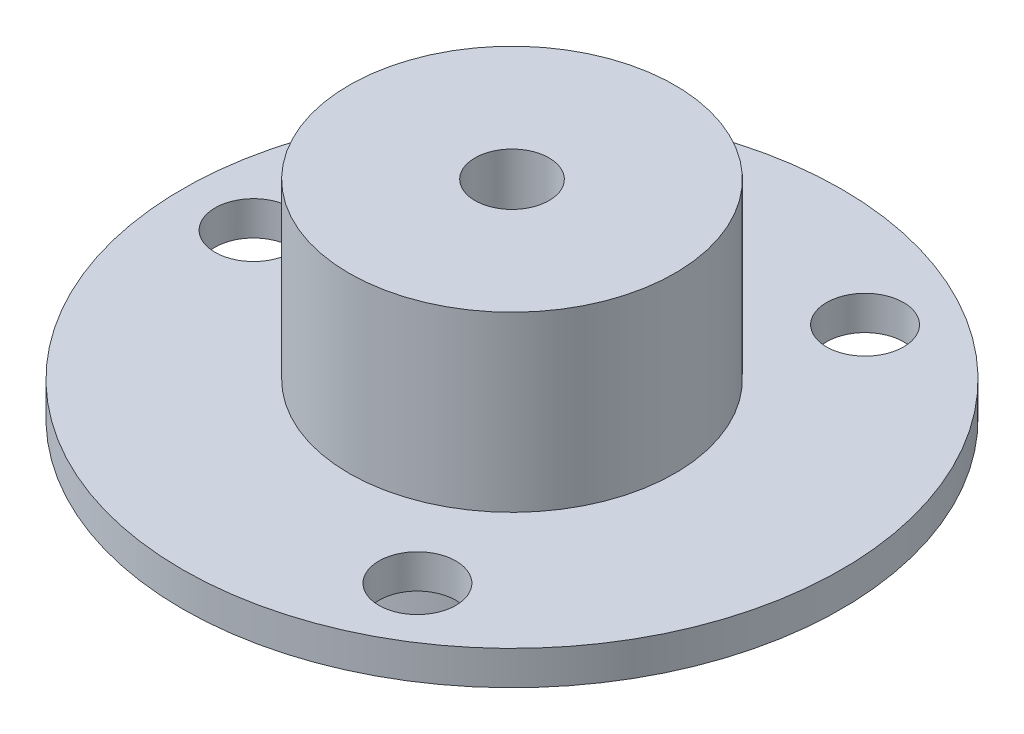
ISO-10303-21;
HEADER;
FILE_DESCRIPTION(('STEP AP214'),'2;1');
FILE_NAME('part.step','',(''),(''),'','','');
FILE_SCHEMA(('AUTOMOTIVE_DESIGN { 1 0 10303 214 1 1 1 1 }'));
ENDSEC;
DATA;
#1=APPLICATION_CONTEXT('core data for automotive mechanical design processes');
#2=APPLICATION_PROTOCOL_DEFINITION('international standard','automotive_design',2000,#1);
#3=PRODUCT_CONTEXT('',#1,'mechanical');
#4=PRODUCT('Part','Part','',(#3));
#5=PRODUCT_RELATED_PRODUCT_CATEGORY('part','',(#4));
#6=PRODUCT_DEFINITION_FORMATION('','',#4);
#7=PRODUCT_DEFINITION_CONTEXT('part definition',#1,'design');
#8=PRODUCT_DEFINITION('design','',#6,#7);
#9=PRODUCT_DEFINITION_SHAPE('','',#8);
#10=(LENGTH_UNIT() NAMED_UNIT(*) SI_UNIT(.MILLI.,.METRE.));
#11=(NAMED_UNIT(*) PLANE_ANGLE_UNIT() SI_UNIT($,.RADIAN.));
#12=(NAMED_UNIT(*) SI_UNIT($,.STERADIAN.) SOLID_ANGLE_UNIT());
#13=UNCERTAINTY_MEASURE_WITH_UNIT(LENGTH_MEASURE(1.E-05),#10,'distance_accuracy_value','');
#14=(GEOMETRIC_REPRESENTATION_CONTEXT(3) GLOBAL_UNCERTAINTY_ASSIGNED_CONTEXT((#13)) GLOBAL_UNIT_ASSIGNED_CONTEXT((#10,
#11,#12)) REPRESENTATION_CONTEXT('',''));
#15=CARTESIAN_POINT('',(0.,0.,0.));
#16=DIRECTION('',(0.,0.,1.));
#17=DIRECTION('',(1.,0.,0.));
#18=AXIS2_PLACEMENT_3D('',#15,#16,#17);
#19=CARTESIAN_POINT('',(-3.10351832152472,-8.,1.61807726266714));
#20=DIRECTION('',(0.,1.,0.));
#21=DIRECTION('',(0.,0.,1.));
#22=AXIS2_PLACEMENT_3D('',#19,#20,#21);
#23=CYLINDRICAL_SURFACE('',#22,0.5);
#24=CARTESIAN_POINT('',(-3.10351832152472,-8.,1.61807726266714));
#25=DIRECTION('',(0.,-1.,0.));
#26=DIRECTION('',(0.,0.,1.));
#27=AXIS2_PLACEMENT_3D('',#24,#25,#26);
#28=CIRCLE('',#27,0.5);
#29=CARTESIAN_POINT('',(-3.10351832152472,-8.,2.11807726266714));
#30=VERTEX_POINT('',#29);
#31=EDGE_CURVE('E11',#30,#30,#28,.T.);
#32=ORIENTED_EDGE('',*,*,#31,.F.);
#33=EDGE_LOOP('',(#32));
#34=FACE_BOUND('',#33,.T.);
#35=CARTESIAN_POINT('',(-3.10351832152472,-5.,1.61807726266714));
#36=DIRECTION('',(0.,-1.,0.));
#37=DIRECTION('',(0.,0.,1.));
#38=AXIS2_PLACEMENT_3D('',#35,#36,#37);
#39=CIRCLE('',#38,0.5);
#40=CARTESIAN_POINT('',(-3.10351832152472,-5.,2.11807726266714));
#41=VERTEX_POINT('',#40);
#42=EDGE_CURVE('E52',#41,#41,#39,.T.);
#43=ORIENTED_EDGE('',*,*,#42,.T.);
#44=EDGE_LOOP('',(#43));
#45=FACE_BOUND('',#44,.T.);
#46=ADVANCED_FACE('F49',(#34,#45),#23,.T.);
#47=CARTESIAN_POINT('',(-3.10351832152472,-8.,1.61807726266714));
#48=DIRECTION('',(0.,1.,0.));
#49=DIRECTION('',(0.,0.,1.));
#50=AXIS2_PLACEMENT_3D('',#47,#48,#49);
#51=PLANE('',#50);
#52=ORIENTED_EDGE('',*,*,#31,.T.);
#53=EDGE_LOOP('',(#52));
#54=FACE_BOUND('',#53,.T.);
#55=ADVANCED_FACE('F64',(#54),#51,.F.);
#56=CARTESIAN_POINT('',(-3.10351832152472,-5.,1.61807726266714));
#57=DIRECTION('',(0.,1.,0.));
#58=DIRECTION('',(0.,0.,1.));
#59=AXIS2_PLACEMENT_3D('',#56,#57,#58);
#60=PLANE('',#59);
#61=ORIENTED_EDGE('',*,*,#42,.F.);
#62=EDGE_LOOP('',(#61));
#63=FACE_BOUND('',#62,.T.);
#64=ADVANCED_FACE('F62',(#63),#60,.T.);
#65=CLOSED_SHELL('',(#46,#55,#64));
#66=MANIFOLD_SOLID_BREP('B2',#65);
#67=CARTESIAN_POINT('',(-3.5,-8.,0.));
#68=DIRECTION('',(0.,1.,0.));
#69=DIRECTION('',(0.,0.,1.));
#70=AXIS2_PLACEMENT_3D('',#67,#68,#69);
#71=CYLINDRICAL_SURFACE('',#70,0.500000000000001);
#72=CARTESIAN_POINT('',(-3.5,-8.,0.));
#73=DIRECTION('',(0.,-1.,0.));
#74=DIRECTION('',(0.,0.,1.));
#75=AXIS2_PLACEMENT_3D('',#72,#73,#74);
#76=CIRCLE('',#75,0.500000000000001);
#77=CARTESIAN_POINT('',(-3.5,-8.,0.500000000000001));
#78=VERTEX_POINT('',#77);
#79=EDGE_CURVE('E48',#78,#78,#76,.T.);
#80=ORIENTED_EDGE('',*,*,#79,.F.);
#81=EDGE_LOOP('',(#80));
#82=FACE_BOUND('',#81,.T.);
#83=CARTESIAN_POINT('',(-3.5,-5.,0.));
#84=DIRECTION('',(0.,-1.,0.));
#85=DIRECTION('',(0.,0.,1.));
#86=AXIS2_PLACEMENT_3D('',#83,#84,#85);
#87=CIRCLE('',#86,0.500000000000001);
#88=CARTESIAN_POINT('',(-3.5,-5.,0.500000000000001));
#89=VERTEX_POINT('',#88);
#90=EDGE_CURVE('E102',#89,#89,#87,.T.);
#91=ORIENTED_EDGE('',*,*,#90,.T.);
#92=EDGE_LOOP('',(#91));
#93=FACE_BOUND('',#92,.T.);
#94=ADVANCED_FACE('F99',(#82,#93),#71,.T.);
#95=CARTESIAN_POINT('',(-3.5,-8.,0.));
#96=DIRECTION('',(0.,1.,0.));
#97=DIRECTION('',(0.,0.,1.));
#98=AXIS2_PLACEMENT_3D('',#95,#96,#97);
#99=PLANE('',#98);
#100=ORIENTED_EDGE('',*,*,#79,.T.);
#101=EDGE_LOOP('',(#100));
#102=FACE_BOUND('',#101,.T.);
#103=ADVANCED_FACE('F114',(#102),#99,.F.);
#104=CARTESIAN_POINT('',(-3.5,-5.,0.));
#105=DIRECTION('',(0.,1.,0.));
#106=DIRECTION('',(0.,0.,1.));
#107=AXIS2_PLACEMENT_3D('',#104,#105,#106);
#108=PLANE('',#107);
#109=ORIENTED_EDGE('',*,*,#90,.F.);
#110=EDGE_LOOP('',(#109));
#111=FACE_BOUND('',#110,.T.);
#112=ADVANCED_FACE('F112',(#111),#108,.T.);
#113=CLOSED_SHELL('',(#94,#103,#112));
#114=MANIFOLD_SOLID_BREP('B6',#113);
#115=CARTESIAN_POINT('',(-3.08989592419614,-8.,-1.64394135468273));
#116=DIRECTION('',(0.,1.,0.));
#117=DIRECTION('',(0.,0.,1.));
#118=AXIS2_PLACEMENT_3D('',#115,#116,#117);
#119=CYLINDRICAL_SURFACE('',#118,0.5);
#120=CARTESIAN_POINT('',(-3.08989592419614,-8.,-1.64394135468273));
#121=DIRECTION('',(0.,-1.,0.));
#122=DIRECTION('',(0.,0.,1.));
#123=AXIS2_PLACEMENT_3D('',#120,#121,#122);
#124=CIRCLE('',#123,0.5);
#125=CARTESIAN_POINT('',(-3.08989592419614,-8.,-1.14394135468273));
#126=VERTEX_POINT('',#125);
#127=EDGE_CURVE('E98',#126,#126,#124,.T.);
#128=ORIENTED_EDGE('',*,*,#127,.F.);
#129=EDGE_LOOP('',(#128));
#130=FACE_BOUND('',#129,.T.);
#131=CARTESIAN_POINT('',(-3.08989592419614,-5.,-1.64394135468273));
#132=DIRECTION('',(0.,-1.,0.));
#133=DIRECTION('',(0.,0.,1.));
#134=AXIS2_PLACEMENT_3D('',#131,#132,#133);
#135=CIRCLE('',#134,0.5);
#136=CARTESIAN_POINT('',(-3.08989592419614,-5.,-1.14394135468273));
#137=VERTEX_POINT('',#136);
#138=EDGE_CURVE('E152',#137,#137,#135,.T.);
#139=ORIENTED_EDGE('',*,*,#138,.T.);
#140=EDGE_LOOP('',(#139));
#141=FACE_BOUND('',#140,.T.);
#142=ADVANCED_FACE('F149',(#130,#141),#119,.T.);
#143=CARTESIAN_POINT('',(-3.08989592419614,-8.,-1.64394135468273));
#144=DIRECTION('',(0.,1.,0.));
#145=DIRECTION('',(0.,0.,1.));
#146=AXIS2_PLACEMENT_3D('',#143,#144,#145);
#147=PLANE('',#146);
#148=ORIENTED_EDGE('',*,*,#127,.T.);
#149=EDGE_LOOP('',(#148));
#150=FACE_BOUND('',#149,.T.);
#151=ADVANCED_FACE('F164',(#150),#147,.F.);
#152=CARTESIAN_POINT('',(-3.08989592419614,-5.,-1.64394135468273));
#153=DIRECTION('',(0.,1.,0.));
#154=DIRECTION('',(0.,0.,1.));
#155=AXIS2_PLACEMENT_3D('',#152,#153,#154);
#156=PLANE('',#155);
#157=ORIENTED_EDGE('',*,*,#138,.F.);
#158=EDGE_LOOP('',(#157));
#159=FACE_BOUND('',#158,.T.);
#160=ADVANCED_FACE('F162',(#159),#156,.T.);
#161=CLOSED_SHELL('',(#142,#151,#160));
#162=MANIFOLD_SOLID_BREP('B43',#161);
#163=CARTESIAN_POINT('',(3.08989592419614,-8.,-1.64394135468273));
#164=DIRECTION('',(0.,1.,0.));
#165=DIRECTION('',(0.,0.,1.));
#166=AXIS2_PLACEMENT_3D('',#163,#164,#165);
#167=CYLINDRICAL_SURFACE('',#166,0.5);
#168=CARTESIAN_POINT('',(3.08989592419614,-8.,-1.64394135468273));
#169=DIRECTION('',(0.,-1.,0.));
#170=DIRECTION('',(0.,0.,-1.));
#171=AXIS2_PLACEMENT_3D('',#168,#169,#170);
#172=CIRCLE('',#171,0.5);
#173=CARTESIAN_POINT('',(3.08989592419614,-8.,-2.14394135468273));
#174=VERTEX_POINT('',#173);
#175=EDGE_CURVE('E148',#174,#174,#172,.T.);
#176=ORIENTED_EDGE('',*,*,#175,.F.);
#177=EDGE_LOOP('',(#176));
#178=FACE_BOUND('',#177,.T.);
#179=CARTESIAN_POINT('',(3.08989592419614,-5.,-1.64394135468273));
#180=DIRECTION('',(0.,-1.,0.));
#181=DIRECTION('',(0.,0.,-1.));
#182=AXIS2_PLACEMENT_3D('',#179,#180,#181);
#183=CIRCLE('',#182,0.5);
#184=CARTESIAN_POINT('',(3.08989592419614,-5.,-2.14394135468273));
#185=VERTEX_POINT('',#184);
#186=EDGE_CURVE('E202',#185,#185,#183,.T.);
#187=ORIENTED_EDGE('',*,*,#186,.T.);
#188=EDGE_LOOP('',(#187));
#189=FACE_BOUND('',#188,.T.);
#190=ADVANCED_FACE('F199',(#178,#189),#167,.T.);
#191=CARTESIAN_POINT('',(3.08989592419614,-8.,-1.64394135468273));
#192=DIRECTION('',(0.,-1.,0.));
#193=DIRECTION('',(0.,0.,-1.));
#194=AXIS2_PLACEMENT_3D('',#191,#192,#193);
#195=PLANE('',#194);
#196=ORIENTED_EDGE('',*,*,#175,.T.);
#197=EDGE_LOOP('',(#196));
#198=FACE_BOUND('',#197,.T.);
#199=ADVANCED_FACE('F214',(#198),#195,.T.);
#200=CARTESIAN_POINT('',(3.08989592419614,-5.,-1.64394135468273));
#201=DIRECTION('',(0.,-1.,0.));
#202=DIRECTION('',(0.,0.,-1.));
#203=AXIS2_PLACEMENT_3D('',#200,#201,#202);
#204=PLANE('',#203);
#205=ORIENTED_EDGE('',*,*,#186,.F.);
#206=EDGE_LOOP('',(#205));
#207=FACE_BOUND('',#206,.T.);
#208=ADVANCED_FACE('F212',(#207),#204,.F.);
#209=CLOSED_SHELL('',(#190,#199,#208));
#210=MANIFOLD_SOLID_BREP('B93',#209);
#211=CARTESIAN_POINT('',(3.5,-8.,0.));
#212=DIRECTION('',(0.,1.,0.));
#213=DIRECTION('',(0.,0.,1.));
#214=AXIS2_PLACEMENT_3D('',#211,#212,#213);
#215=CYLINDRICAL_SURFACE('',#214,0.500000000000001);
#216=CARTESIAN_POINT('',(3.5,-8.,0.));
#217=DIRECTION('',(0.,-1.,0.));
#218=DIRECTION('',(0.,0.,-1.));
#219=AXIS2_PLACEMENT_3D('',#216,#217,#218);
#220=CIRCLE('',#219,0.500000000000001);
#221=CARTESIAN_POINT('',(3.5,-8.,-0.500000000000001));
#222=VERTEX_POINT('',#221);
#223=EDGE_CURVE('E198',#222,#222,#220,.T.);
#224=ORIENTED_EDGE('',*,*,#223,.F.);
#225=EDGE_LOOP('',(#224));
#226=FACE_BOUND('',#225,.T.);
#227=CARTESIAN_POINT('',(3.5,-5.,0.));
#228=DIRECTION('',(0.,-1.,0.));
#229=DIRECTION('',(0.,0.,-1.));
#230=AXIS2_PLACEMENT_3D('',#227,#228,#229);
#231=CIRCLE('',#230,0.500000000000001);
#232=CARTESIAN_POINT('',(3.5,-5.,-0.500000000000001));
#233=VERTEX_POINT('',#232);
#234=EDGE_CURVE('E252',#233,#233,#231,.T.);
#235=ORIENTED_EDGE('',*,*,#234,.T.);
#236=EDGE_LOOP('',(#235));
#237=FACE_BOUND('',#236,.T.);
#238=ADVANCED_FACE('F249',(#226,#237),#215,.T.);
#239=CARTESIAN_POINT('',(3.5,-8.,0.));
#240=DIRECTION('',(0.,-1.,0.));
#241=DIRECTION('',(0.,0.,-1.));
#242=AXIS2_PLACEMENT_3D('',#239,#240,#241);
#243=PLANE('',#242);
#244=ORIENTED_EDGE('',*,*,#223,.T.);
#245=EDGE_LOOP('',(#244));
#246=FACE_BOUND('',#245,.T.);
#247=ADVANCED_FACE('F264',(#246),#243,.T.);
#248=CARTESIAN_POINT('',(3.5,-5.,0.));
#249=DIRECTION('',(0.,-1.,0.));
#250=DIRECTION('',(0.,0.,-1.));
#251=AXIS2_PLACEMENT_3D('',#248,#249,#250);
#252=PLANE('',#251);
#253=ORIENTED_EDGE('',*,*,#234,.F.);
#254=EDGE_LOOP('',(#253));
#255=FACE_BOUND('',#254,.T.);
#256=ADVANCED_FACE('F262',(#255),#252,.F.);
#257=CLOSED_SHELL('',(#238,#247,#256));
#258=MANIFOLD_SOLID_BREP('B143',#257);
#259=CARTESIAN_POINT('',(3.10351832152472,-8.,1.61807726266714));
#260=DIRECTION('',(0.,1.,0.));
#261=DIRECTION('',(0.,0.,1.));
#262=AXIS2_PLACEMENT_3D('',#259,#260,#261);
#263=CYLINDRICAL_SURFACE('',#262,0.5);
#264=CARTESIAN_POINT('',(3.10351832152472,-8.,1.61807726266714));
#265=DIRECTION('',(0.,-1.,0.));
#266=DIRECTION('',(0.,0.,-1.));
#267=AXIS2_PLACEMENT_3D('',#264,#265,#266);
#268=CIRCLE('',#267,0.5);
#269=CARTESIAN_POINT('',(3.10351832152472,-8.,1.11807726266714));
#270=VERTEX_POINT('',#269);
#271=EDGE_CURVE('E248',#270,#270,#268,.T.);
#272=ORIENTED_EDGE('',*,*,#271,.F.);
#273=EDGE_LOOP('',(#272));
#274=FACE_BOUND('',#273,.T.);
#275=CARTESIAN_POINT('',(3.10351832152472,-5.,1.61807726266714));
#276=DIRECTION('',(0.,-1.,0.));
#277=DIRECTION('',(0.,0.,-1.));
#278=AXIS2_PLACEMENT_3D('',#275,#276,#277);
#279=CIRCLE('',#278,0.5);
#280=CARTESIAN_POINT('',(3.10351832152472,-5.,1.11807726266714));
#281=VERTEX_POINT('',#280);
#282=EDGE_CURVE('E301',#281,#281,#279,.T.);
#283=ORIENTED_EDGE('',*,*,#282,.T.);
#284=EDGE_LOOP('',(#283));
#285=FACE_BOUND('',#284,.T.);
#286=ADVANCED_FACE('F298',(#274,#285),#263,.T.);
#287=CARTESIAN_POINT('',(3.10351832152472,-8.,1.61807726266714));
#288=DIRECTION('',(0.,-1.,0.));
#289=DIRECTION('',(0.,0.,-1.));
#290=AXIS2_PLACEMENT_3D('',#287,#288,#289);
#291=PLANE('',#290);
#292=ORIENTED_EDGE('',*,*,#271,.T.);
#293=EDGE_LOOP('',(#292));
#294=FACE_BOUND('',#293,.T.);
#295=ADVANCED_FACE('F313',(#294),#291,.T.);
#296=CARTESIAN_POINT('',(3.10351832152472,-5.,1.61807726266714));
#297=DIRECTION('',(0.,-1.,0.));
#298=DIRECTION('',(0.,0.,-1.));
#299=AXIS2_PLACEMENT_3D('',#296,#297,#298);
#300=PLANE('',#299);
#301=ORIENTED_EDGE('',*,*,#282,.F.);
#302=EDGE_LOOP('',(#301));
#303=FACE_BOUND('',#302,.T.);
#304=ADVANCED_FACE('F311',(#303),#300,.F.);
#305=CLOSED_SHELL('',(#286,#295,#304));
#306=MANIFOLD_SOLID_BREP('B193',#305);
#307=CARTESIAN_POINT('',(0.,0.,0.));
#308=DIRECTION('',(0.,1.,0.));
#309=DIRECTION('',(0.,0.,1.));
#310=AXIS2_PLACEMENT_3D('',#307,#308,#309);
#311=PLANE('',#310);
#312=CARTESIAN_POINT('',(0.,0.,0.));
#313=DIRECTION('',(0.,1.,0.));
#314=DIRECTION('',(0.,0.,1.));
#315=AXIS2_PLACEMENT_3D('',#312,#313,#314);
#316=CIRCLE('',#315,11.);
#317=CARTESIAN_POINT('',(0.,0.,11.));
#318=VERTEX_POINT('',#317);
#319=EDGE_CURVE('E356',#318,#318,#316,.T.);
#320=ORIENTED_EDGE('',*,*,#319,.F.);
#321=EDGE_LOOP('',(#320));
#322=FACE_BOUND('',#321,.T.);
#323=CARTESIAN_POINT('',(0.,0.,0.));
#324=DIRECTION('',(0.,1.,0.));
#325=DIRECTION('',(0.,0.,1.));
#326=AXIS2_PLACEMENT_3D('',#323,#324,#325);
#327=CIRCLE('',#326,4.5);
#328=CARTESIAN_POINT('',(0.,0.,4.5));
#329=VERTEX_POINT('',#328);
#330=EDGE_CURVE('E297',#329,#329,#327,.F.);
#331=ORIENTED_EDGE('',*,*,#330,.F.);
#332=EDGE_LOOP('',(#331));
#333=FACE_BOUND('',#332,.T.);
#334=ADVANCED_FACE('F340',(#322,#333),#311,.F.);
#335=CARTESIAN_POINT('',(0.,19.,0.));
#336=DIRECTION('',(0.,-1.,0.));
#337=DIRECTION('',(0.,0.,-1.));
#338=AXIS2_PLACEMENT_3D('',#335,#336,#337);
#339=CYLINDRICAL_SURFACE('',#338,11.);
#340=CARTESIAN_POINT('',(0.,7.3,0.));
#341=DIRECTION('',(0.,1.,0.));
#342=DIRECTION('',(0.,0.,1.));
#343=AXIS2_PLACEMENT_3D('',#340,#341,#342);
#344=CIRCLE('',#343,11.);
#345=CARTESIAN_POINT('',(0.,7.3,11.));
#346=VERTEX_POINT('',#345);
#347=EDGE_CURVE('E359',#346,#346,#344,.T.);
#348=ORIENTED_EDGE('',*,*,#347,.T.);
#349=EDGE_LOOP('',(#348));
#350=FACE_BOUND('',#349,.T.);
#351=CARTESIAN_POINT('',(0.,19.,0.));
#352=DIRECTION('',(0.,1.,0.));
#353=DIRECTION('',(0.,0.,1.));
#354=AXIS2_PLACEMENT_3D('',#351,#352,#353);
#355=CIRCLE('',#354,11.);
#356=CARTESIAN_POINT('',(0.,19.,11.));
#357=VERTEX_POINT('',#356);
#358=EDGE_CURVE('E351',#357,#357,#355,.T.);
#359=ORIENTED_EDGE('',*,*,#358,.F.);
#360=EDGE_LOOP('',(#359));
#361=FACE_BOUND('',#360,.T.);
#362=ADVANCED_FACE('F342',(#350,#361),#339,.T.);
#363=CARTESIAN_POINT('',(0.,19.,0.));
#364=DIRECTION('',(0.,1.,0.));
#365=DIRECTION('',(0.,0.,1.));
#366=AXIS2_PLACEMENT_3D('',#363,#364,#365);
#367=PLANE('',#366);
#368=CARTESIAN_POINT('',(0.,19.,0.));
#369=DIRECTION('',(0.,-1.,0.));
#370=DIRECTION('',(0.,0.,-1.));
#371=AXIS2_PLACEMENT_3D('',#368,#369,#370);
#372=CIRCLE('',#371,2.5);
#373=CARTESIAN_POINT('',(0.,19.,-2.5));
#374=VERTEX_POINT('',#373);
#375=EDGE_CURVE('E371',#374,#374,#372,.T.);
#376=ORIENTED_EDGE('',*,*,#375,.T.);
#377=EDGE_LOOP('',(#376));
#378=FACE_BOUND('',#377,.T.);
#379=ORIENTED_EDGE('',*,*,#358,.T.);
#380=EDGE_LOOP('',(#379));
#381=FACE_BOUND('',#380,.T.);
#382=ADVANCED_FACE('F423',(#378,#381),#367,.T.);
#383=CARTESIAN_POINT('',(0.,7.3,0.));
#384=DIRECTION('',(0.,-1.,0.));
#385=DIRECTION('',(0.,0.,-1.));
#386=AXIS2_PLACEMENT_3D('',#383,#384,#385);
#387=CYLINDRICAL_SURFACE('',#386,22.25);
#388=CARTESIAN_POINT('',(0.,7.3,0.));
#389=DIRECTION('',(0.,1.,0.));
#390=DIRECTION('',(0.,0.,1.));
#391=AXIS2_PLACEMENT_3D('',#388,#389,#390);
#392=CIRCLE('',#391,22.25);
#393=CARTESIAN_POINT('',(0.,7.3,22.25));
#394=VERTEX_POINT('',#393);
#395=EDGE_CURVE('E361',#394,#394,#392,.T.);
#396=ORIENTED_EDGE('',*,*,#395,.F.);
#397=EDGE_LOOP('',(#396));
#398=FACE_BOUND('',#397,.T.);
#399=CARTESIAN_POINT('',(0.,5.,0.));
#400=DIRECTION('',(0.,1.,0.));
#401=DIRECTION('',(0.,0.,1.));
#402=AXIS2_PLACEMENT_3D('',#399,#400,#401);
#403=CIRCLE('',#402,22.25);
#404=CARTESIAN_POINT('',(0.,5.,22.25));
#405=VERTEX_POINT('',#404);
#406=EDGE_CURVE('E366',#405,#405,#403,.T.);
#407=ORIENTED_EDGE('',*,*,#406,.T.);
#408=EDGE_LOOP('',(#407));
#409=FACE_BOUND('',#408,.T.);
#410=ADVANCED_FACE('F430',(#398,#409),#387,.T.);
#411=CARTESIAN_POINT('',(0.,7.3,0.));
#412=DIRECTION('',(0.,1.,0.));
#413=DIRECTION('',(0.,0.,1.));
#414=AXIS2_PLACEMENT_3D('',#411,#412,#413);
#415=PLANE('',#414);
#416=CARTESIAN_POINT('',(8.725,7.3,15.1121432960385));
#417=DIRECTION('',(0.,1.,0.));
#418=DIRECTION('',(0.,0.,1.));
#419=AXIS2_PLACEMENT_3D('',#416,#417,#418);
#420=CIRCLE('',#419,2.6);
#421=CARTESIAN_POINT('',(8.725,7.3,17.7121432960385));
#422=VERTEX_POINT('',#421);
#423=EDGE_CURVE('E376',#422,#422,#420,.T.);
#424=ORIENTED_EDGE('',*,*,#423,.F.);
#425=EDGE_LOOP('',(#424));
#426=FACE_BOUND('',#425,.T.);
#427=CARTESIAN_POINT('',(-17.45,7.3,0.));
#428=DIRECTION('',(0.,1.,0.));
#429=DIRECTION('',(0.,0.,1.));
#430=AXIS2_PLACEMENT_3D('',#427,#428,#429);
#431=CIRCLE('',#430,2.6);
#432=CARTESIAN_POINT('',(-17.45,7.3,2.6));
#433=VERTEX_POINT('',#432);
#434=EDGE_CURVE('E379',#433,#433,#431,.T.);
#435=ORIENTED_EDGE('',*,*,#434,.F.);
#436=EDGE_LOOP('',(#435));
#437=FACE_BOUND('',#436,.T.);
#438=CARTESIAN_POINT('',(8.72500000000001,7.3,-15.1121432960385));
#439=DIRECTION('',(0.,1.,0.));
#440=DIRECTION('',(0.,0.,1.));
#441=AXIS2_PLACEMENT_3D('',#438,#439,#440);
#442=CIRCLE('',#441,2.6);
#443=CARTESIAN_POINT('',(8.72500000000001,7.3,-12.5121432960385));
#444=VERTEX_POINT('',#443);
#445=EDGE_CURVE('E382',#444,#444,#442,.T.);
#446=ORIENTED_EDGE('',*,*,#445,.F.);
#447=EDGE_LOOP('',(#446));
#448=FACE_BOUND('',#447,.T.);
#449=ORIENTED_EDGE('',*,*,#347,.F.);
#450=EDGE_LOOP('',(#449));
#451=FACE_BOUND('',#450,.T.);
#452=ORIENTED_EDGE('',*,*,#395,.T.);
#453=EDGE_LOOP('',(#452));
#454=FACE_BOUND('',#453,.T.);
#455=ADVANCED_FACE('F434',(#426,#437,#448,#451,#454),#415,.T.);
#456=CARTESIAN_POINT('',(0.,5.,0.));
#457=DIRECTION('',(0.,1.,0.));
#458=DIRECTION('',(0.,0.,1.));
#459=AXIS2_PLACEMENT_3D('',#456,#457,#458);
#460=PLANE('',#459);
#461=CARTESIAN_POINT('',(8.725,5.,15.1121432960385));
#462=DIRECTION('',(0.,-1.,0.));
#463=DIRECTION('',(0.,0.,-1.));
#464=AXIS2_PLACEMENT_3D('',#461,#462,#463);
#465=CIRCLE('',#464,2.6);
#466=CARTESIAN_POINT('',(8.725,5.,12.5121432960385));
#467=VERTEX_POINT('',#466);
#468=EDGE_CURVE('E385',#467,#467,#465,.T.);
#469=ORIENTED_EDGE('',*,*,#468,.F.);
#470=EDGE_LOOP('',(#469));
#471=FACE_BOUND('',#470,.T.);
#472=CARTESIAN_POINT('',(-17.45,5.,0.));
#473=DIRECTION('',(0.,-1.,0.));
#474=DIRECTION('',(0.,0.,-1.));
#475=AXIS2_PLACEMENT_3D('',#472,#473,#474);
#476=CIRCLE('',#475,2.6);
#477=CARTESIAN_POINT('',(-17.45,5.,-2.6));
#478=VERTEX_POINT('',#477);
#479=EDGE_CURVE('E389',#478,#478,#476,.T.);
#480=ORIENTED_EDGE('',*,*,#479,.F.);
#481=EDGE_LOOP('',(#480));
#482=FACE_BOUND('',#481,.T.);
#483=CARTESIAN_POINT('',(8.72500000000001,5.,-15.1121432960385));
#484=DIRECTION('',(0.,-1.,0.));
#485=DIRECTION('',(0.,0.,-1.));
#486=AXIS2_PLACEMENT_3D('',#483,#484,#485);
#487=CIRCLE('',#486,2.6);
#488=CARTESIAN_POINT('',(8.72500000000001,5.,-17.7121432960385));
#489=VERTEX_POINT('',#488);
#490=EDGE_CURVE('E386',#489,#489,#487,.T.);
#491=ORIENTED_EDGE('',*,*,#490,.F.);
#492=EDGE_LOOP('',(#491));
#493=FACE_BOUND('',#492,.T.);
#494=CARTESIAN_POINT('',(0.,5.,0.));
#495=DIRECTION('',(0.,1.,0.));
#496=DIRECTION('',(0.,0.,1.));
#497=AXIS2_PLACEMENT_3D('',#494,#495,#496);
#498=CIRCLE('',#497,11.);
#499=CARTESIAN_POINT('',(0.,5.,11.));
#500=VERTEX_POINT('',#499);
#501=EDGE_CURVE('E347',#500,#500,#498,.T.);
#502=ORIENTED_EDGE('',*,*,#501,.T.);
#503=EDGE_LOOP('',(#502));
#504=FACE_BOUND('',#503,.T.);
#505=ORIENTED_EDGE('',*,*,#406,.F.);
#506=EDGE_LOOP('',(#505));
#507=FACE_BOUND('',#506,.T.);
#508=ADVANCED_FACE('F436',(#471,#482,#493,#504,#507),#460,.F.);
#509=ORIENTED_EDGE('',*,*,#319,.T.);
#510=EDGE_LOOP('',(#509));
#511=FACE_BOUND('',#510,.T.);
#512=ORIENTED_EDGE('',*,*,#501,.F.);
#513=EDGE_LOOP('',(#512));
#514=FACE_BOUND('',#513,.T.);
#515=ADVANCED_FACE('F424',(#511,#514),#339,.T.);
#516=CARTESIAN_POINT('',(0.,19.,0.));
#517=DIRECTION('',(0.,-1.,0.));
#518=DIRECTION('',(0.,0.,-1.));
#519=AXIS2_PLACEMENT_3D('',#516,#517,#518);
#520=CYLINDRICAL_SURFACE('',#519,2.5);
#521=ORIENTED_EDGE('',*,*,#375,.F.);
#522=EDGE_LOOP('',(#521));
#523=FACE_BOUND('',#522,.T.);
#524=CARTESIAN_POINT('',(0.,-5.,0.));
#525=DIRECTION('',(0.,-1.,0.));
#526=DIRECTION('',(0.,0.,-1.));
#527=AXIS2_PLACEMENT_3D('',#524,#525,#526);
#528=CIRCLE('',#527,2.5);
#529=CARTESIAN_POINT('',(0.,-5.,-2.5));
#530=VERTEX_POINT('',#529);
#531=EDGE_CURVE('E397',#530,#530,#528,.T.);
#532=ORIENTED_EDGE('',*,*,#531,.T.);
#533=EDGE_LOOP('',(#532));
#534=FACE_BOUND('',#533,.T.);
#535=ADVANCED_FACE('F401',(#523,#534),#520,.F.);
#536=CARTESIAN_POINT('',(8.72500000000001,19.,-15.1121432960385));
#537=DIRECTION('',(0.,-1.,0.));
#538=DIRECTION('',(0.,0.,-1.));
#539=AXIS2_PLACEMENT_3D('',#536,#537,#538);
#540=CYLINDRICAL_SURFACE('',#539,2.6);
#541=ORIENTED_EDGE('',*,*,#445,.T.);
#542=EDGE_LOOP('',(#541));
#543=FACE_BOUND('',#542,.T.);
#544=ORIENTED_EDGE('',*,*,#490,.T.);
#545=EDGE_LOOP('',(#544));
#546=FACE_BOUND('',#545,.T.);
#547=ADVANCED_FACE('F445',(#543,#546),#540,.F.);
#548=CARTESIAN_POINT('',(-17.45,19.,0.));
#549=DIRECTION('',(0.,-1.,0.));
#550=DIRECTION('',(0.,0.,-1.));
#551=AXIS2_PLACEMENT_3D('',#548,#549,#550);
#552=CYLINDRICAL_SURFACE('',#551,2.6);
#553=ORIENTED_EDGE('',*,*,#434,.T.);
#554=EDGE_LOOP('',(#553));
#555=FACE_BOUND('',#554,.T.);
#556=ORIENTED_EDGE('',*,*,#479,.T.);
#557=EDGE_LOOP('',(#556));
#558=FACE_BOUND('',#557,.T.);
#559=ADVANCED_FACE('F415',(#555,#558),#552,.F.);
#560=CARTESIAN_POINT('',(8.725,19.,15.1121432960385));
#561=DIRECTION('',(0.,-1.,0.));
#562=DIRECTION('',(0.,0.,-1.));
#563=AXIS2_PLACEMENT_3D('',#560,#561,#562);
#564=CYLINDRICAL_SURFACE('',#563,2.6);
#565=ORIENTED_EDGE('',*,*,#423,.T.);
#566=EDGE_LOOP('',(#565));
#567=FACE_BOUND('',#566,.T.);
#568=ORIENTED_EDGE('',*,*,#468,.T.);
#569=EDGE_LOOP('',(#568));
#570=FACE_BOUND('',#569,.T.);
#571=ADVANCED_FACE('F406',(#567,#570),#564,.F.);
#572=CARTESIAN_POINT('',(0.,-5.,0.));
#573=DIRECTION('',(0.,-1.,0.));
#574=DIRECTION('',(0.,0.,-1.));
#575=AXIS2_PLACEMENT_3D('',#572,#573,#574);
#576=PLANE('',#575);
#577=CARTESIAN_POINT('',(0.,-5.,0.));
#578=DIRECTION('',(0.,-1.,0.));
#579=DIRECTION('',(0.,0.,-1.));
#580=AXIS2_PLACEMENT_3D('',#577,#578,#579);
#581=CIRCLE('',#580,4.5);
#582=CARTESIAN_POINT('',(0.,-5.,-4.5));
#583=VERTEX_POINT('',#582);
#584=EDGE_CURVE('E390',#583,#583,#581,.T.);
#585=ORIENTED_EDGE('',*,*,#584,.T.);
#586=EDGE_LOOP('',(#585));
#587=FACE_BOUND('',#586,.T.);
#588=ORIENTED_EDGE('',*,*,#531,.F.);
#589=EDGE_LOOP('',(#588));
#590=FACE_BOUND('',#589,.T.);
#591=ADVANCED_FACE('F403',(#587,#590),#576,.T.);
#592=CARTESIAN_POINT('',(0.,-5.,0.));
#593=DIRECTION('',(0.,1.,0.));
#594=DIRECTION('',(0.,0.,1.));
#595=AXIS2_PLACEMENT_3D('',#592,#593,#594);
#596=CYLINDRICAL_SURFACE('',#595,4.5);
#597=ORIENTED_EDGE('',*,*,#584,.F.);
#598=EDGE_LOOP('',(#597));
#599=FACE_BOUND('',#598,.T.);
#600=ORIENTED_EDGE('',*,*,#330,.T.);
#601=EDGE_LOOP('',(#600));
#602=FACE_BOUND('',#601,.T.);
#603=ADVANCED_FACE('F405',(#599,#602),#596,.T.);
#604=CLOSED_SHELL('',(#334,#362,#382,#410,#455,#508,#515,#535,#547,#559,#571,#591,#603));
#605=MANIFOLD_SOLID_BREP('B243',#604);
#606=ADVANCED_BREP_SHAPE_REPRESENTATION('',(#18,#66,#114,#162,#210,#258,#306,#605),#14);
#607=SHAPE_DEFINITION_REPRESENTATION(#9,#606);
ENDSEC;
END-ISO-10303-21;
